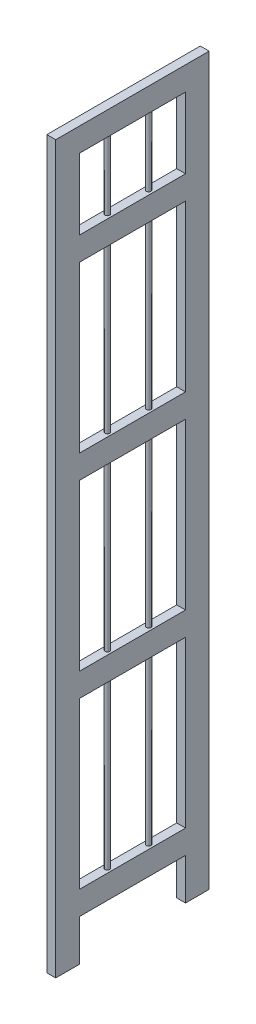
ISO-10303-21;
HEADER;
FILE_DESCRIPTION(('STEP AP214'),'2;1');
FILE_NAME('part.step','',(''),(''),'','','');
FILE_SCHEMA(('AUTOMOTIVE_DESIGN { 1 0 10303 214 1 1 1 1 }'));
ENDSEC;
DATA;
#1=APPLICATION_CONTEXT('core data for automotive mechanical design processes');
#2=APPLICATION_PROTOCOL_DEFINITION('international standard','automotive_design',2000,#1);
#3=PRODUCT_CONTEXT('',#1,'mechanical');
#4=PRODUCT('Part','Part','',(#3));
#5=PRODUCT_RELATED_PRODUCT_CATEGORY('part','',(#4));
#6=PRODUCT_DEFINITION_FORMATION('','',#4);
#7=PRODUCT_DEFINITION_CONTEXT('part definition',#1,'design');
#8=PRODUCT_DEFINITION('design','',#6,#7);
#9=PRODUCT_DEFINITION_SHAPE('','',#8);
#10=(LENGTH_UNIT() NAMED_UNIT(*) SI_UNIT(.MILLI.,.METRE.));
#11=(NAMED_UNIT(*) PLANE_ANGLE_UNIT() SI_UNIT($,.RADIAN.));
#12=(NAMED_UNIT(*) SI_UNIT($,.STERADIAN.) SOLID_ANGLE_UNIT());
#13=UNCERTAINTY_MEASURE_WITH_UNIT(LENGTH_MEASURE(1.E-05),#10,'distance_accuracy_value','');
#14=(GEOMETRIC_REPRESENTATION_CONTEXT(3) GLOBAL_UNCERTAINTY_ASSIGNED_CONTEXT((#13)) GLOBAL_UNIT_ASSIGNED_CONTEXT((#10,
#11,#12)) REPRESENTATION_CONTEXT('',''));
#15=CARTESIAN_POINT('',(0.,0.,0.));
#16=DIRECTION('',(0.,0.,1.));
#17=DIRECTION('',(1.,0.,0.));
#18=AXIS2_PLACEMENT_3D('',#15,#16,#17);
#19=CARTESIAN_POINT('',(-15.,1190.,90.));
#20=DIRECTION('',(0.,-1.,0.));
#21=DIRECTION('',(0.,0.,-1.));
#22=AXIS2_PLACEMENT_3D('',#19,#20,#21);
#23=PLANE('',#22);
#24=CARTESIAN_POINT('',(-7.5,1190.,-35.));
#25=DIRECTION('',(0.,-1.,0.));
#26=DIRECTION('',(0.,0.,-1.));
#27=AXIS2_PLACEMENT_3D('',#24,#25,#26);
#28=CIRCLE('',#27,4.);
#29=CARTESIAN_POINT('',(-7.5,1190.,-39.));
#30=VERTEX_POINT('',#29);
#31=EDGE_CURVE('E11',#30,#30,#28,.T.);
#32=ORIENTED_EDGE('',*,*,#31,.F.);
#33=EDGE_LOOP('',(#32));
#34=FACE_BOUND('',#33,.T.);
#35=DIRECTION('',(0.,0.,-1.));
#36=VECTOR('',#35,1.);
#37=CARTESIAN_POINT('',(0.,1190.,90.));
#38=LINE('',#37,#36);
#39=CARTESIAN_POINT('',(0.,1190.,90.));
#40=VERTEX_POINT('',#39);
#41=CARTESIAN_POINT('',(0.,1190.,-90.));
#42=VERTEX_POINT('',#41);
#43=EDGE_CURVE('E228',#40,#42,#38,.T.);
#44=ORIENTED_EDGE('',*,*,#43,.F.);
#45=DIRECTION('',(1.,0.,0.));
#46=VECTOR('',#45,1.);
#47=CARTESIAN_POINT('',(-15.,1190.,90.));
#48=LINE('',#47,#46);
#49=CARTESIAN_POINT('',(-15.,1190.,90.));
#50=VERTEX_POINT('',#49);
#51=EDGE_CURVE('E263',#50,#40,#48,.T.);
#52=ORIENTED_EDGE('',*,*,#51,.F.);
#53=DIRECTION('',(0.,0.,-1.));
#54=VECTOR('',#53,1.);
#55=CARTESIAN_POINT('',(-15.,1190.,90.));
#56=LINE('',#55,#54);
#57=CARTESIAN_POINT('',(-15.,1190.,-90.));
#58=VERTEX_POINT('',#57);
#59=EDGE_CURVE('E386',#50,#58,#56,.T.);
#60=ORIENTED_EDGE('',*,*,#59,.T.);
#61=DIRECTION('',(1.,0.,0.));
#62=VECTOR('',#61,1.);
#63=CARTESIAN_POINT('',(-15.,1190.,-90.));
#64=LINE('',#63,#62);
#65=EDGE_CURVE('E261',#58,#42,#64,.T.);
#66=ORIENTED_EDGE('',*,*,#65,.T.);
#67=EDGE_LOOP('',(#44,#52,#60,#66));
#68=FACE_BOUND('',#67,.T.);
#69=CARTESIAN_POINT('',(-7.5,1190.,35.));
#70=DIRECTION('',(0.,-1.,0.));
#71=DIRECTION('',(0.,0.,-1.));
#72=AXIS2_PLACEMENT_3D('',#69,#70,#71);
#73=CIRCLE('',#72,4.);
#74=CARTESIAN_POINT('',(-7.5,1190.,31.));
#75=VERTEX_POINT('',#74);
#76=EDGE_CURVE('E273',#75,#75,#73,.T.);
#77=ORIENTED_EDGE('',*,*,#76,.F.);
#78=EDGE_LOOP('',(#77));
#79=FACE_BOUND('',#78,.T.);
#80=ADVANCED_FACE('F35',(#34,#68,#79),#23,.T.);
#81=CARTESIAN_POINT('',(-199.390889145858,110.,90.));
#82=DIRECTION('',(0.,1.,0.));
#83=DIRECTION('',(0.,0.,1.));
#84=AXIS2_PLACEMENT_3D('',#81,#82,#83);
#85=PLANE('',#84);
#86=CARTESIAN_POINT('',(-7.5,110.,-35.));
#87=DIRECTION('',(0.,1.,0.));
#88=DIRECTION('',(0.,0.,1.));
#89=AXIS2_PLACEMENT_3D('',#86,#87,#88);
#90=CIRCLE('',#89,4.);
#91=CARTESIAN_POINT('',(-7.5,110.,-31.));
#92=VERTEX_POINT('',#91);
#93=EDGE_CURVE('E43',#92,#92,#90,.T.);
#94=ORIENTED_EDGE('',*,*,#93,.F.);
#95=EDGE_LOOP('',(#94));
#96=FACE_BOUND('',#95,.T.);
#97=DIRECTION('',(0.,0.,-1.));
#98=VECTOR('',#97,1.);
#99=CARTESIAN_POINT('',(-15.,110.,90.));
#100=LINE('',#99,#98);
#101=CARTESIAN_POINT('',(-15.,110.,90.));
#102=VERTEX_POINT('',#101);
#103=CARTESIAN_POINT('',(-15.,110.,-90.));
#104=VERTEX_POINT('',#103);
#105=EDGE_CURVE('E360',#102,#104,#100,.T.);
#106=ORIENTED_EDGE('',*,*,#105,.F.);
#107=DIRECTION('',(1.,0.,0.));
#108=VECTOR('',#107,1.);
#109=CARTESIAN_POINT('',(-199.390889145858,110.,90.));
#110=LINE('',#109,#108);
#111=CARTESIAN_POINT('',(0.,110.,90.));
#112=VERTEX_POINT('',#111);
#113=EDGE_CURVE('E364',#102,#112,#110,.T.);
#114=ORIENTED_EDGE('',*,*,#113,.T.);
#115=DIRECTION('',(0.,0.,1.));
#116=VECTOR('',#115,1.);
#117=CARTESIAN_POINT('',(0.,110.,90.));
#118=LINE('',#117,#116);
#119=CARTESIAN_POINT('',(0.,110.,-90.));
#120=VERTEX_POINT('',#119);
#121=EDGE_CURVE('E366',#120,#112,#118,.T.);
#122=ORIENTED_EDGE('',*,*,#121,.F.);
#123=DIRECTION('',(1.,0.,0.));
#124=VECTOR('',#123,1.);
#125=CARTESIAN_POINT('',(-199.390889145858,110.,-90.));
#126=LINE('',#125,#124);
#127=EDGE_CURVE('E371',#104,#120,#126,.T.);
#128=ORIENTED_EDGE('',*,*,#127,.F.);
#129=EDGE_LOOP('',(#106,#114,#122,#128));
#130=FACE_BOUND('',#129,.T.);
#131=CARTESIAN_POINT('',(-7.5,110.,35.));
#132=DIRECTION('',(0.,1.,0.));
#133=DIRECTION('',(0.,0.,1.));
#134=AXIS2_PLACEMENT_3D('',#131,#132,#133);
#135=CIRCLE('',#134,4.);
#136=CARTESIAN_POINT('',(-7.5,110.,39.));
#137=VERTEX_POINT('',#136);
#138=EDGE_CURVE('E290',#137,#137,#135,.T.);
#139=ORIENTED_EDGE('',*,*,#138,.F.);
#140=EDGE_LOOP('',(#139));
#141=FACE_BOUND('',#140,.T.);
#142=ADVANCED_FACE('F483',(#96,#130,#141),#85,.T.);
#143=CARTESIAN_POINT('',(-199.390889145858,430.,90.));
#144=DIRECTION('',(0.,1.,0.));
#145=DIRECTION('',(0.,0.,1.));
#146=AXIS2_PLACEMENT_3D('',#143,#144,#145);
#147=PLANE('',#146);
#148=CARTESIAN_POINT('',(-7.5,430.,-35.));
#149=DIRECTION('',(0.,1.,0.));
#150=DIRECTION('',(0.,0.,1.));
#151=AXIS2_PLACEMENT_3D('',#148,#149,#150);
#152=CIRCLE('',#151,4.);
#153=CARTESIAN_POINT('',(-7.5,430.,-31.));
#154=VERTEX_POINT('',#153);
#155=EDGE_CURVE('E277',#154,#154,#152,.T.);
#156=ORIENTED_EDGE('',*,*,#155,.F.);
#157=EDGE_LOOP('',(#156));
#158=FACE_BOUND('',#157,.T.);
#159=DIRECTION('',(0.,0.,-1.));
#160=VECTOR('',#159,1.);
#161=CARTESIAN_POINT('',(-15.,430.,90.));
#162=LINE('',#161,#160);
#163=CARTESIAN_POINT('',(-15.,430.,90.));
#164=VERTEX_POINT('',#163);
#165=CARTESIAN_POINT('',(-15.,430.,-90.));
#166=VERTEX_POINT('',#165);
#167=EDGE_CURVE('E339',#164,#166,#162,.T.);
#168=ORIENTED_EDGE('',*,*,#167,.F.);
#169=DIRECTION('',(1.,0.,0.));
#170=VECTOR('',#169,1.);
#171=CARTESIAN_POINT('',(-199.390889145858,430.,90.));
#172=LINE('',#171,#170);
#173=CARTESIAN_POINT('',(0.,430.,90.));
#174=VERTEX_POINT('',#173);
#175=EDGE_CURVE('E343',#164,#174,#172,.T.);
#176=ORIENTED_EDGE('',*,*,#175,.T.);
#177=DIRECTION('',(0.,0.,1.));
#178=VECTOR('',#177,1.);
#179=CARTESIAN_POINT('',(0.,430.,90.));
#180=LINE('',#179,#178);
#181=CARTESIAN_POINT('',(0.,430.,-90.));
#182=VERTEX_POINT('',#181);
#183=EDGE_CURVE('E345',#182,#174,#180,.T.);
#184=ORIENTED_EDGE('',*,*,#183,.F.);
#185=DIRECTION('',(1.,0.,0.));
#186=VECTOR('',#185,1.);
#187=CARTESIAN_POINT('',(-199.390889145858,430.,-90.));
#188=LINE('',#187,#186);
#189=EDGE_CURVE('E350',#166,#182,#188,.T.);
#190=ORIENTED_EDGE('',*,*,#189,.F.);
#191=EDGE_LOOP('',(#168,#176,#184,#190));
#192=FACE_BOUND('',#191,.T.);
#193=CARTESIAN_POINT('',(-7.5,430.,35.));
#194=DIRECTION('',(0.,1.,0.));
#195=DIRECTION('',(0.,0.,1.));
#196=AXIS2_PLACEMENT_3D('',#193,#194,#195);
#197=CIRCLE('',#196,4.);
#198=CARTESIAN_POINT('',(-7.5,430.,39.));
#199=VERTEX_POINT('',#198);
#200=EDGE_CURVE('E203',#199,#199,#197,.F.);
#201=ORIENTED_EDGE('',*,*,#200,.T.);
#202=EDGE_LOOP('',(#201));
#203=FACE_BOUND('',#202,.T.);
#204=ADVANCED_FACE('F489',(#158,#192,#203),#147,.T.);
#205=CARTESIAN_POINT('',(-199.390889145858,390.,90.));
#206=DIRECTION('',(0.,-1.,0.));
#207=DIRECTION('',(0.,0.,-1.));
#208=AXIS2_PLACEMENT_3D('',#205,#206,#207);
#209=PLANE('',#208);
#210=CARTESIAN_POINT('',(-7.5,390.,-35.));
#211=DIRECTION('',(0.,-1.,0.));
#212=DIRECTION('',(0.,0.,-1.));
#213=AXIS2_PLACEMENT_3D('',#210,#211,#212);
#214=CIRCLE('',#213,4.);
#215=CARTESIAN_POINT('',(-7.5,390.,-39.));
#216=VERTEX_POINT('',#215);
#217=EDGE_CURVE('E281',#216,#216,#214,.T.);
#218=ORIENTED_EDGE('',*,*,#217,.F.);
#219=EDGE_LOOP('',(#218));
#220=FACE_BOUND('',#219,.T.);
#221=DIRECTION('',(0.,0.,1.));
#222=VECTOR('',#221,1.);
#223=CARTESIAN_POINT('',(-15.,390.,90.));
#224=LINE('',#223,#222);
#225=CARTESIAN_POINT('',(-15.,390.,-90.));
#226=VERTEX_POINT('',#225);
#227=CARTESIAN_POINT('',(-15.,390.,90.));
#228=VERTEX_POINT('',#227);
#229=EDGE_CURVE('E342',#226,#228,#224,.T.);
#230=ORIENTED_EDGE('',*,*,#229,.F.);
#231=DIRECTION('',(1.,0.,0.));
#232=VECTOR('',#231,1.);
#233=CARTESIAN_POINT('',(-199.390889145858,390.,-90.));
#234=LINE('',#233,#232);
#235=CARTESIAN_POINT('',(0.,390.,-90.));
#236=VERTEX_POINT('',#235);
#237=EDGE_CURVE('E353',#226,#236,#234,.T.);
#238=ORIENTED_EDGE('',*,*,#237,.T.);
#239=DIRECTION('',(0.,0.,-1.));
#240=VECTOR('',#239,1.);
#241=CARTESIAN_POINT('',(0.,390.,90.));
#242=LINE('',#241,#240);
#243=CARTESIAN_POINT('',(0.,390.,90.));
#244=VERTEX_POINT('',#243);
#245=EDGE_CURVE('E338',#244,#236,#242,.T.);
#246=ORIENTED_EDGE('',*,*,#245,.F.);
#247=DIRECTION('',(1.,0.,0.));
#248=VECTOR('',#247,1.);
#249=CARTESIAN_POINT('',(-199.390889145858,390.,90.));
#250=LINE('',#249,#248);
#251=EDGE_CURVE('E347',#228,#244,#250,.T.);
#252=ORIENTED_EDGE('',*,*,#251,.F.);
#253=EDGE_LOOP('',(#230,#238,#246,#252));
#254=FACE_BOUND('',#253,.T.);
#255=CARTESIAN_POINT('',(-7.5,390.,35.));
#256=DIRECTION('',(0.,-1.,0.));
#257=DIRECTION('',(0.,0.,-1.));
#258=AXIS2_PLACEMENT_3D('',#255,#256,#257);
#259=CIRCLE('',#258,4.);
#260=CARTESIAN_POINT('',(-7.5,390.,31.));
#261=VERTEX_POINT('',#260);
#262=EDGE_CURVE('E303',#261,#261,#259,.F.);
#263=ORIENTED_EDGE('',*,*,#262,.T.);
#264=EDGE_LOOP('',(#263));
#265=FACE_BOUND('',#264,.T.);
#266=ADVANCED_FACE('F454',(#220,#254,#265),#209,.T.);
#267=CARTESIAN_POINT('',(-199.390889145858,750.,90.));
#268=DIRECTION('',(0.,1.,0.));
#269=DIRECTION('',(0.,0.,1.));
#270=AXIS2_PLACEMENT_3D('',#267,#268,#269);
#271=PLANE('',#270);
#272=CARTESIAN_POINT('',(-7.5,750.,-35.));
#273=DIRECTION('',(0.,1.,0.));
#274=DIRECTION('',(0.,0.,1.));
#275=AXIS2_PLACEMENT_3D('',#272,#273,#274);
#276=CIRCLE('',#275,4.);
#277=CARTESIAN_POINT('',(-7.5,750.,-31.));
#278=VERTEX_POINT('',#277);
#279=EDGE_CURVE('E286',#278,#278,#276,.T.);
#280=ORIENTED_EDGE('',*,*,#279,.F.);
#281=EDGE_LOOP('',(#280));
#282=FACE_BOUND('',#281,.T.);
#283=DIRECTION('',(0.,0.,-1.));
#284=VECTOR('',#283,1.);
#285=CARTESIAN_POINT('',(-15.,750.,90.));
#286=LINE('',#285,#284);
#287=CARTESIAN_POINT('',(-15.,750.,90.));
#288=VERTEX_POINT('',#287);
#289=CARTESIAN_POINT('',(-15.,750.,-90.));
#290=VERTEX_POINT('',#289);
#291=EDGE_CURVE('E320',#288,#290,#286,.T.);
#292=ORIENTED_EDGE('',*,*,#291,.F.);
#293=DIRECTION('',(1.,0.,0.));
#294=VECTOR('',#293,1.);
#295=CARTESIAN_POINT('',(-199.390889145858,750.,90.));
#296=LINE('',#295,#294);
#297=CARTESIAN_POINT('',(0.,750.,90.));
#298=VERTEX_POINT('',#297);
#299=EDGE_CURVE('E324',#288,#298,#296,.T.);
#300=ORIENTED_EDGE('',*,*,#299,.T.);
#301=DIRECTION('',(0.,0.,1.));
#302=VECTOR('',#301,1.);
#303=CARTESIAN_POINT('',(0.,750.,90.));
#304=LINE('',#303,#302);
#305=CARTESIAN_POINT('',(0.,750.,-90.));
#306=VERTEX_POINT('',#305);
#307=EDGE_CURVE('E216',#306,#298,#304,.T.);
#308=ORIENTED_EDGE('',*,*,#307,.F.);
#309=DIRECTION('',(1.,0.,0.));
#310=VECTOR('',#309,1.);
#311=CARTESIAN_POINT('',(-199.390889145858,750.,-90.));
#312=LINE('',#311,#310);
#313=EDGE_CURVE('E329',#290,#306,#312,.T.);
#314=ORIENTED_EDGE('',*,*,#313,.F.);
#315=EDGE_LOOP('',(#292,#300,#308,#314));
#316=FACE_BOUND('',#315,.T.);
#317=CARTESIAN_POINT('',(-7.5,750.,35.));
#318=DIRECTION('',(0.,1.,0.));
#319=DIRECTION('',(0.,0.,1.));
#320=AXIS2_PLACEMENT_3D('',#317,#318,#319);
#321=CIRCLE('',#320,4.);
#322=CARTESIAN_POINT('',(-7.5,750.,39.));
#323=VERTEX_POINT('',#322);
#324=EDGE_CURVE('E300',#323,#323,#321,.F.);
#325=ORIENTED_EDGE('',*,*,#324,.T.);
#326=EDGE_LOOP('',(#325));
#327=FACE_BOUND('',#326,.T.);
#328=ADVANCED_FACE('F450',(#282,#316,#327),#271,.T.);
#329=CARTESIAN_POINT('',(-199.390889145858,710.,90.));
#330=DIRECTION('',(0.,-1.,0.));
#331=DIRECTION('',(0.,0.,-1.));
#332=AXIS2_PLACEMENT_3D('',#329,#330,#331);
#333=PLANE('',#332);
#334=CARTESIAN_POINT('',(-7.5,710.,-35.));
#335=DIRECTION('',(0.,-1.,0.));
#336=DIRECTION('',(0.,0.,-1.));
#337=AXIS2_PLACEMENT_3D('',#334,#335,#336);
#338=CIRCLE('',#337,4.);
#339=CARTESIAN_POINT('',(-7.5,710.,-39.));
#340=VERTEX_POINT('',#339);
#341=EDGE_CURVE('E615',#340,#340,#338,.T.);
#342=ORIENTED_EDGE('',*,*,#341,.F.);
#343=EDGE_LOOP('',(#342));
#344=FACE_BOUND('',#343,.T.);
#345=DIRECTION('',(0.,0.,1.));
#346=VECTOR('',#345,1.);
#347=CARTESIAN_POINT('',(-15.,710.,90.));
#348=LINE('',#347,#346);
#349=CARTESIAN_POINT('',(-15.,710.,-90.));
#350=VERTEX_POINT('',#349);
#351=CARTESIAN_POINT('',(-15.,710.,90.));
#352=VERTEX_POINT('',#351);
#353=EDGE_CURVE('E323',#350,#352,#348,.T.);
#354=ORIENTED_EDGE('',*,*,#353,.F.);
#355=DIRECTION('',(1.,0.,0.));
#356=VECTOR('',#355,1.);
#357=CARTESIAN_POINT('',(-199.390889145858,710.,-90.));
#358=LINE('',#357,#356);
#359=CARTESIAN_POINT('',(0.,710.,-90.));
#360=VERTEX_POINT('',#359);
#361=EDGE_CURVE('E332',#350,#360,#358,.T.);
#362=ORIENTED_EDGE('',*,*,#361,.T.);
#363=DIRECTION('',(0.,0.,-1.));
#364=VECTOR('',#363,1.);
#365=CARTESIAN_POINT('',(0.,710.,90.));
#366=LINE('',#365,#364);
#367=CARTESIAN_POINT('',(0.,710.,90.));
#368=VERTEX_POINT('',#367);
#369=EDGE_CURVE('E319',#368,#360,#366,.T.);
#370=ORIENTED_EDGE('',*,*,#369,.F.);
#371=DIRECTION('',(1.,0.,0.));
#372=VECTOR('',#371,1.);
#373=CARTESIAN_POINT('',(-199.390889145858,710.,90.));
#374=LINE('',#373,#372);
#375=EDGE_CURVE('E327',#352,#368,#374,.T.);
#376=ORIENTED_EDGE('',*,*,#375,.F.);
#377=EDGE_LOOP('',(#354,#362,#370,#376));
#378=FACE_BOUND('',#377,.T.);
#379=CARTESIAN_POINT('',(-7.5,710.,35.));
#380=DIRECTION('',(0.,-1.,0.));
#381=DIRECTION('',(0.,0.,-1.));
#382=AXIS2_PLACEMENT_3D('',#379,#380,#381);
#383=CIRCLE('',#382,4.);
#384=CARTESIAN_POINT('',(-7.5,710.,31.));
#385=VERTEX_POINT('',#384);
#386=EDGE_CURVE('E297',#385,#385,#383,.F.);
#387=ORIENTED_EDGE('',*,*,#386,.T.);
#388=EDGE_LOOP('',(#387));
#389=FACE_BOUND('',#388,.T.);
#390=ADVANCED_FACE('F453',(#344,#378,#389),#333,.T.);
#391=CARTESIAN_POINT('',(-199.390889145858,1070.,90.));
#392=DIRECTION('',(0.,1.,0.));
#393=DIRECTION('',(0.,0.,1.));
#394=AXIS2_PLACEMENT_3D('',#391,#392,#393);
#395=PLANE('',#394);
#396=CARTESIAN_POINT('',(-7.5,1070.,-35.));
#397=DIRECTION('',(0.,1.,0.));
#398=DIRECTION('',(0.,0.,1.));
#399=AXIS2_PLACEMENT_3D('',#396,#397,#398);
#400=CIRCLE('',#399,4.);
#401=CARTESIAN_POINT('',(-7.5,1070.,-31.));
#402=VERTEX_POINT('',#401);
#403=EDGE_CURVE('E275',#402,#402,#400,.T.);
#404=ORIENTED_EDGE('',*,*,#403,.F.);
#405=EDGE_LOOP('',(#404));
#406=FACE_BOUND('',#405,.T.);
#407=DIRECTION('',(0.,0.,-1.));
#408=VECTOR('',#407,1.);
#409=CARTESIAN_POINT('',(-15.,1070.,90.));
#410=LINE('',#409,#408);
#411=CARTESIAN_POINT('',(-15.,1070.,90.));
#412=VERTEX_POINT('',#411);
#413=CARTESIAN_POINT('',(-15.,1070.,-90.));
#414=VERTEX_POINT('',#413);
#415=EDGE_CURVE('E308',#412,#414,#410,.T.);
#416=ORIENTED_EDGE('',*,*,#415,.F.);
#417=DIRECTION('',(1.,0.,0.));
#418=VECTOR('',#417,1.);
#419=CARTESIAN_POINT('',(-199.390889145858,1070.,90.));
#420=LINE('',#419,#418);
#421=CARTESIAN_POINT('',(0.,1070.,90.));
#422=VERTEX_POINT('',#421);
#423=EDGE_CURVE('E310',#412,#422,#420,.T.);
#424=ORIENTED_EDGE('',*,*,#423,.T.);
#425=DIRECTION('',(0.,0.,1.));
#426=VECTOR('',#425,1.);
#427=CARTESIAN_POINT('',(0.,1070.,90.));
#428=LINE('',#427,#426);
#429=CARTESIAN_POINT('',(0.,1070.,-90.));
#430=VERTEX_POINT('',#429);
#431=EDGE_CURVE('E58',#430,#422,#428,.T.);
#432=ORIENTED_EDGE('',*,*,#431,.F.);
#433=DIRECTION('',(1.,0.,0.));
#434=VECTOR('',#433,1.);
#435=CARTESIAN_POINT('',(-199.390889145858,1070.,-90.));
#436=LINE('',#435,#434);
#437=EDGE_CURVE('E314',#414,#430,#436,.T.);
#438=ORIENTED_EDGE('',*,*,#437,.F.);
#439=EDGE_LOOP('',(#416,#424,#432,#438));
#440=FACE_BOUND('',#439,.T.);
#441=CARTESIAN_POINT('',(-7.5,1070.,35.));
#442=DIRECTION('',(0.,1.,0.));
#443=DIRECTION('',(0.,0.,1.));
#444=AXIS2_PLACEMENT_3D('',#441,#442,#443);
#445=CIRCLE('',#444,4.);
#446=CARTESIAN_POINT('',(-7.5,1070.,39.));
#447=VERTEX_POINT('',#446);
#448=EDGE_CURVE('E272',#447,#447,#445,.F.);
#449=ORIENTED_EDGE('',*,*,#448,.T.);
#450=EDGE_LOOP('',(#449));
#451=FACE_BOUND('',#450,.T.);
#452=ADVANCED_FACE('F469',(#406,#440,#451),#395,.T.);
#453=CARTESIAN_POINT('',(-199.390889145858,1030.,90.));
#454=DIRECTION('',(0.,-1.,0.));
#455=DIRECTION('',(0.,0.,-1.));
#456=AXIS2_PLACEMENT_3D('',#453,#454,#455);
#457=PLANE('',#456);
#458=CARTESIAN_POINT('',(-7.5,1030.,-35.));
#459=DIRECTION('',(0.,-1.,0.));
#460=DIRECTION('',(0.,0.,-1.));
#461=AXIS2_PLACEMENT_3D('',#458,#459,#460);
#462=CIRCLE('',#461,4.);
#463=CARTESIAN_POINT('',(-7.5,1030.,-39.));
#464=VERTEX_POINT('',#463);
#465=EDGE_CURVE('E251',#464,#464,#462,.T.);
#466=ORIENTED_EDGE('',*,*,#465,.F.);
#467=EDGE_LOOP('',(#466));
#468=FACE_BOUND('',#467,.T.);
#469=DIRECTION('',(0.,0.,1.));
#470=VECTOR('',#469,1.);
#471=CARTESIAN_POINT('',(-15.,1030.,90.));
#472=LINE('',#471,#470);
#473=CARTESIAN_POINT('',(-15.,1030.,-90.));
#474=VERTEX_POINT('',#473);
#475=CARTESIAN_POINT('',(-15.,1030.,90.));
#476=VERTEX_POINT('',#475);
#477=EDGE_CURVE('E309',#474,#476,#472,.T.);
#478=ORIENTED_EDGE('',*,*,#477,.F.);
#479=DIRECTION('',(1.,0.,0.));
#480=VECTOR('',#479,1.);
#481=CARTESIAN_POINT('',(-199.390889145858,1030.,-90.));
#482=LINE('',#481,#480);
#483=CARTESIAN_POINT('',(0.,1030.,-90.));
#484=VERTEX_POINT('',#483);
#485=EDGE_CURVE('E201',#474,#484,#482,.T.);
#486=ORIENTED_EDGE('',*,*,#485,.T.);
#487=DIRECTION('',(0.,0.,-1.));
#488=VECTOR('',#487,1.);
#489=CARTESIAN_POINT('',(0.,1030.,90.));
#490=LINE('',#489,#488);
#491=CARTESIAN_POINT('',(0.,1030.,90.));
#492=VERTEX_POINT('',#491);
#493=EDGE_CURVE('E50',#492,#484,#490,.T.);
#494=ORIENTED_EDGE('',*,*,#493,.F.);
#495=DIRECTION('',(1.,0.,0.));
#496=VECTOR('',#495,1.);
#497=CARTESIAN_POINT('',(-199.390889145858,1030.,90.));
#498=LINE('',#497,#496);
#499=EDGE_CURVE('E198',#476,#492,#498,.T.);
#500=ORIENTED_EDGE('',*,*,#499,.F.);
#501=EDGE_LOOP('',(#478,#486,#494,#500));
#502=FACE_BOUND('',#501,.T.);
#503=CARTESIAN_POINT('',(-7.5,1030.,35.));
#504=DIRECTION('',(0.,-1.,0.));
#505=DIRECTION('',(0.,0.,-1.));
#506=AXIS2_PLACEMENT_3D('',#503,#504,#505);
#507=CIRCLE('',#506,4.);
#508=CARTESIAN_POINT('',(-7.5,1030.,31.));
#509=VERTEX_POINT('',#508);
#510=EDGE_CURVE('E269',#509,#509,#507,.F.);
#511=ORIENTED_EDGE('',*,*,#510,.T.);
#512=EDGE_LOOP('',(#511));
#513=FACE_BOUND('',#512,.T.);
#514=ADVANCED_FACE('F196',(#468,#502,#513),#457,.T.);
#515=CARTESIAN_POINT('',(-15.,0.,-90.));
#516=DIRECTION('',(0.,0.,1.));
#517=DIRECTION('',(1.,0.,0.));
#518=AXIS2_PLACEMENT_3D('',#515,#516,#517);
#519=PLANE('',#518);
#520=ORIENTED_EDGE('',*,*,#437,.T.);
#521=DIRECTION('',(0.,-1.,0.));
#522=VECTOR('',#521,1.);
#523=CARTESIAN_POINT('',(0.,0.,-90.));
#524=LINE('',#523,#522);
#525=EDGE_CURVE('E233',#42,#430,#524,.T.);
#526=ORIENTED_EDGE('',*,*,#525,.F.);
#527=ORIENTED_EDGE('',*,*,#65,.F.);
#528=DIRECTION('',(0.,-1.,0.));
#529=VECTOR('',#528,1.);
#530=CARTESIAN_POINT('',(-15.,0.,-90.));
#531=LINE('',#530,#529);
#532=EDGE_CURVE('E391',#58,#414,#531,.T.);
#533=ORIENTED_EDGE('',*,*,#532,.T.);
#534=EDGE_LOOP('',(#520,#526,#527,#533));
#535=FACE_BOUND('',#534,.T.);
#536=ADVANCED_FACE('F468',(#535),#519,.T.);
#537=CARTESIAN_POINT('',(-15.,0.,90.));
#538=DIRECTION('',(0.,0.,-1.));
#539=DIRECTION('',(-1.,0.,0.));
#540=AXIS2_PLACEMENT_3D('',#537,#538,#539);
#541=PLANE('',#540);
#542=ORIENTED_EDGE('',*,*,#423,.F.);
#543=DIRECTION('',(0.,1.,0.));
#544=VECTOR('',#543,1.);
#545=CARTESIAN_POINT('',(-15.,0.,90.));
#546=LINE('',#545,#544);
#547=EDGE_CURVE('E382',#412,#50,#546,.T.);
#548=ORIENTED_EDGE('',*,*,#547,.T.);
#549=ORIENTED_EDGE('',*,*,#51,.T.);
#550=DIRECTION('',(0.,1.,0.));
#551=VECTOR('',#550,1.);
#552=CARTESIAN_POINT('',(0.,0.,90.));
#553=LINE('',#552,#551);
#554=EDGE_CURVE('E219',#422,#40,#553,.T.);
#555=ORIENTED_EDGE('',*,*,#554,.F.);
#556=EDGE_LOOP('',(#542,#548,#549,#555));
#557=FACE_BOUND('',#556,.T.);
#558=ADVANCED_FACE('F476',(#557),#541,.T.);
#559=ORIENTED_EDGE('',*,*,#485,.F.);
#560=EDGE_CURVE('E395',#474,#290,#531,.T.);
#561=ORIENTED_EDGE('',*,*,#560,.T.);
#562=ORIENTED_EDGE('',*,*,#313,.T.);
#563=EDGE_CURVE('E236',#484,#306,#524,.T.);
#564=ORIENTED_EDGE('',*,*,#563,.F.);
#565=EDGE_LOOP('',(#559,#561,#562,#564));
#566=FACE_BOUND('',#565,.T.);
#567=ADVANCED_FACE('F445',(#566),#519,.T.);
#568=ORIENTED_EDGE('',*,*,#499,.T.);
#569=EDGE_CURVE('E209',#298,#492,#553,.T.);
#570=ORIENTED_EDGE('',*,*,#569,.F.);
#571=ORIENTED_EDGE('',*,*,#299,.F.);
#572=EDGE_CURVE('E211',#288,#476,#546,.T.);
#573=ORIENTED_EDGE('',*,*,#572,.T.);
#574=EDGE_LOOP('',(#568,#570,#571,#573));
#575=FACE_BOUND('',#574,.T.);
#576=ADVANCED_FACE('F207',(#575),#541,.T.);
#577=ORIENTED_EDGE('',*,*,#361,.F.);
#578=EDGE_CURVE('E436',#350,#166,#531,.T.);
#579=ORIENTED_EDGE('',*,*,#578,.T.);
#580=ORIENTED_EDGE('',*,*,#189,.T.);
#581=EDGE_CURVE('E688',#360,#182,#524,.T.);
#582=ORIENTED_EDGE('',*,*,#581,.F.);
#583=EDGE_LOOP('',(#577,#579,#580,#582));
#584=FACE_BOUND('',#583,.T.);
#585=ADVANCED_FACE('F515',(#584),#519,.T.);
#586=ORIENTED_EDGE('',*,*,#375,.T.);
#587=EDGE_CURVE('E218',#174,#368,#553,.T.);
#588=ORIENTED_EDGE('',*,*,#587,.F.);
#589=ORIENTED_EDGE('',*,*,#175,.F.);
#590=EDGE_CURVE('E668',#164,#352,#546,.T.);
#591=ORIENTED_EDGE('',*,*,#590,.T.);
#592=EDGE_LOOP('',(#586,#588,#589,#591));
#593=FACE_BOUND('',#592,.T.);
#594=ADVANCED_FACE('F510',(#593),#541,.T.);
#595=ORIENTED_EDGE('',*,*,#237,.F.);
#596=EDGE_CURVE('E435',#226,#104,#531,.T.);
#597=ORIENTED_EDGE('',*,*,#596,.T.);
#598=ORIENTED_EDGE('',*,*,#127,.T.);
#599=EDGE_CURVE('E684',#236,#120,#524,.T.);
#600=ORIENTED_EDGE('',*,*,#599,.F.);
#601=EDGE_LOOP('',(#595,#597,#598,#600));
#602=FACE_BOUND('',#601,.T.);
#603=ADVANCED_FACE('F505',(#602),#519,.T.);
#604=ORIENTED_EDGE('',*,*,#251,.T.);
#605=EDGE_CURVE('E222',#112,#244,#553,.T.);
#606=ORIENTED_EDGE('',*,*,#605,.F.);
#607=ORIENTED_EDGE('',*,*,#113,.F.);
#608=EDGE_CURVE('E387',#102,#228,#546,.T.);
#609=ORIENTED_EDGE('',*,*,#608,.T.);
#610=EDGE_LOOP('',(#604,#606,#607,#609));
#611=FACE_BOUND('',#610,.T.);
#612=ADVANCED_FACE('F498',(#611),#541,.T.);
#613=CARTESIAN_POINT('',(-15.,0.,130.));
#614=DIRECTION('',(0.,-1.,0.));
#615=DIRECTION('',(0.,0.,-1.));
#616=AXIS2_PLACEMENT_3D('',#613,#614,#615);
#617=PLANE('',#616);
#618=DIRECTION('',(0.,0.,-1.));
#619=VECTOR('',#618,1.);
#620=CARTESIAN_POINT('',(0.,0.,130.));
#621=LINE('',#620,#619);
#622=CARTESIAN_POINT('',(0.,0.,130.));
#623=VERTEX_POINT('',#622);
#624=CARTESIAN_POINT('',(0.,0.,90.));
#625=VERTEX_POINT('',#624);
#626=EDGE_CURVE('E223',#623,#625,#621,.T.);
#627=ORIENTED_EDGE('',*,*,#626,.F.);
#628=DIRECTION('',(1.,0.,0.));
#629=VECTOR('',#628,1.);
#630=CARTESIAN_POINT('',(-15.,0.,130.));
#631=LINE('',#630,#629);
#632=CARTESIAN_POINT('',(-15.,0.,130.));
#633=VERTEX_POINT('',#632);
#634=EDGE_CURVE('E249',#633,#623,#631,.T.);
#635=ORIENTED_EDGE('',*,*,#634,.F.);
#636=DIRECTION('',(0.,0.,-1.));
#637=VECTOR('',#636,1.);
#638=CARTESIAN_POINT('',(-15.,0.,130.));
#639=LINE('',#638,#637);
#640=CARTESIAN_POINT('',(-15.,0.,90.));
#641=VERTEX_POINT('',#640);
#642=EDGE_CURVE('E248',#633,#641,#639,.T.);
#643=ORIENTED_EDGE('',*,*,#642,.T.);
#644=DIRECTION('',(1.,0.,0.));
#645=VECTOR('',#644,1.);
#646=CARTESIAN_POINT('',(-15.,0.,90.));
#647=LINE('',#646,#645);
#648=EDGE_CURVE('E266',#641,#625,#647,.T.);
#649=ORIENTED_EDGE('',*,*,#648,.T.);
#650=EDGE_LOOP('',(#627,#635,#643,#649));
#651=FACE_BOUND('',#650,.T.);
#652=ADVANCED_FACE('F37',(#651),#617,.T.);
#653=CARTESIAN_POINT('',(-15.,0.,130.));
#654=DIRECTION('',(0.,0.,1.));
#655=DIRECTION('',(1.,0.,0.));
#656=AXIS2_PLACEMENT_3D('',#653,#654,#655);
#657=PLANE('',#656);
#658=DIRECTION('',(0.,-1.,0.));
#659=VECTOR('',#658,1.);
#660=CARTESIAN_POINT('',(0.,0.,130.));
#661=LINE('',#660,#659);
#662=CARTESIAN_POINT('',(0.,1230.,130.));
#663=VERTEX_POINT('',#662);
#664=EDGE_CURVE('E245',#663,#623,#661,.T.);
#665=ORIENTED_EDGE('',*,*,#664,.F.);
#666=DIRECTION('',(1.,0.,0.));
#667=VECTOR('',#666,1.);
#668=CARTESIAN_POINT('',(-15.,1230.,130.));
#669=LINE('',#668,#667);
#670=CARTESIAN_POINT('',(-15.,1230.,130.));
#671=VERTEX_POINT('',#670);
#672=EDGE_CURVE('E252',#671,#663,#669,.T.);
#673=ORIENTED_EDGE('',*,*,#672,.F.);
#674=DIRECTION('',(0.,-1.,0.));
#675=VECTOR('',#674,1.);
#676=CARTESIAN_POINT('',(-15.,0.,130.));
#677=LINE('',#676,#675);
#678=EDGE_CURVE('E268',#671,#633,#677,.T.);
#679=ORIENTED_EDGE('',*,*,#678,.T.);
#680=ORIENTED_EDGE('',*,*,#634,.T.);
#681=EDGE_LOOP('',(#665,#673,#679,#680));
#682=FACE_BOUND('',#681,.T.);
#683=ADVANCED_FACE('F407',(#682),#657,.T.);
#684=CARTESIAN_POINT('',(-15.,1230.,130.));
#685=DIRECTION('',(0.,1.,0.));
#686=DIRECTION('',(0.,0.,1.));
#687=AXIS2_PLACEMENT_3D('',#684,#685,#686);
#688=PLANE('',#687);
#689=DIRECTION('',(0.,0.,1.));
#690=VECTOR('',#689,1.);
#691=CARTESIAN_POINT('',(0.,1230.,130.));
#692=LINE('',#691,#690);
#693=CARTESIAN_POINT('',(0.,1230.,-130.));
#694=VERTEX_POINT('',#693);
#695=EDGE_CURVE('E242',#694,#663,#692,.T.);
#696=ORIENTED_EDGE('',*,*,#695,.F.);
#697=DIRECTION('',(1.,0.,0.));
#698=VECTOR('',#697,1.);
#699=CARTESIAN_POINT('',(-15.,1230.,-130.));
#700=LINE('',#699,#698);
#701=CARTESIAN_POINT('',(-15.,1230.,-130.));
#702=VERTEX_POINT('',#701);
#703=EDGE_CURVE('E254',#702,#694,#700,.T.);
#704=ORIENTED_EDGE('',*,*,#703,.F.);
#705=DIRECTION('',(0.,0.,1.));
#706=VECTOR('',#705,1.);
#707=CARTESIAN_POINT('',(-15.,1230.,130.));
#708=LINE('',#707,#706);
#709=EDGE_CURVE('E401',#702,#671,#708,.T.);
#710=ORIENTED_EDGE('',*,*,#709,.T.);
#711=ORIENTED_EDGE('',*,*,#672,.T.);
#712=EDGE_LOOP('',(#696,#704,#710,#711));
#713=FACE_BOUND('',#712,.T.);
#714=ADVANCED_FACE('F422',(#713),#688,.T.);
#715=CARTESIAN_POINT('',(-15.,0.,-130.));
#716=DIRECTION('',(0.,0.,-1.));
#717=DIRECTION('',(-1.,0.,0.));
#718=AXIS2_PLACEMENT_3D('',#715,#716,#717);
#719=PLANE('',#718);
#720=DIRECTION('',(0.,1.,0.));
#721=VECTOR('',#720,1.);
#722=CARTESIAN_POINT('',(0.,0.,-130.));
#723=LINE('',#722,#721);
#724=CARTESIAN_POINT('',(0.,0.,-130.));
#725=VERTEX_POINT('',#724);
#726=EDGE_CURVE('E239',#725,#694,#723,.T.);
#727=ORIENTED_EDGE('',*,*,#726,.F.);
#728=DIRECTION('',(1.,0.,0.));
#729=VECTOR('',#728,1.);
#730=CARTESIAN_POINT('',(-15.,0.,-130.));
#731=LINE('',#730,#729);
#732=CARTESIAN_POINT('',(-15.,0.,-130.));
#733=VERTEX_POINT('',#732);
#734=EDGE_CURVE('E256',#733,#725,#731,.T.);
#735=ORIENTED_EDGE('',*,*,#734,.F.);
#736=DIRECTION('',(0.,1.,0.));
#737=VECTOR('',#736,1.);
#738=CARTESIAN_POINT('',(-15.,0.,-130.));
#739=LINE('',#738,#737);
#740=EDGE_CURVE('E398',#733,#702,#739,.T.);
#741=ORIENTED_EDGE('',*,*,#740,.T.);
#742=ORIENTED_EDGE('',*,*,#703,.T.);
#743=EDGE_LOOP('',(#727,#735,#741,#742));
#744=FACE_BOUND('',#743,.T.);
#745=ADVANCED_FACE('F424',(#744),#719,.T.);
#746=CARTESIAN_POINT('',(-15.,0.,-90.));
#747=DIRECTION('',(0.,-1.,0.));
#748=DIRECTION('',(0.,0.,-1.));
#749=AXIS2_PLACEMENT_3D('',#746,#747,#748);
#750=PLANE('',#749);
#751=DIRECTION('',(0.,0.,-1.));
#752=VECTOR('',#751,1.);
#753=CARTESIAN_POINT('',(0.,0.,-90.));
#754=LINE('',#753,#752);
#755=CARTESIAN_POINT('',(0.,0.,-90.));
#756=VERTEX_POINT('',#755);
#757=EDGE_CURVE('E235',#756,#725,#754,.T.);
#758=ORIENTED_EDGE('',*,*,#757,.F.);
#759=DIRECTION('',(1.,0.,0.));
#760=VECTOR('',#759,1.);
#761=CARTESIAN_POINT('',(-15.,0.,-90.));
#762=LINE('',#761,#760);
#763=CARTESIAN_POINT('',(-15.,0.,-90.));
#764=VERTEX_POINT('',#763);
#765=EDGE_CURVE('E258',#764,#756,#762,.T.);
#766=ORIENTED_EDGE('',*,*,#765,.F.);
#767=DIRECTION('',(0.,0.,-1.));
#768=VECTOR('',#767,1.);
#769=CARTESIAN_POINT('',(-15.,0.,-90.));
#770=LINE('',#769,#768);
#771=EDGE_CURVE('E394',#764,#733,#770,.T.);
#772=ORIENTED_EDGE('',*,*,#771,.T.);
#773=ORIENTED_EDGE('',*,*,#734,.T.);
#774=EDGE_LOOP('',(#758,#766,#772,#773));
#775=FACE_BOUND('',#774,.T.);
#776=ADVANCED_FACE('F430',(#775),#750,.T.);
#777=DIRECTION('',(1.,0.,0.));
#778=VECTOR('',#777,1.);
#779=CARTESIAN_POINT('',(-199.390889145858,70.0000000000001,-90.));
#780=LINE('',#779,#778);
#781=CARTESIAN_POINT('',(-15.,70.0000000000001,-90.));
#782=VERTEX_POINT('',#781);
#783=CARTESIAN_POINT('',(0.,70.,-90.));
#784=VERTEX_POINT('',#783);
#785=EDGE_CURVE('E374',#782,#784,#780,.T.);
#786=ORIENTED_EDGE('',*,*,#785,.F.);
#787=EDGE_CURVE('E390',#782,#764,#531,.T.);
#788=ORIENTED_EDGE('',*,*,#787,.T.);
#789=ORIENTED_EDGE('',*,*,#765,.T.);
#790=EDGE_CURVE('E232',#784,#756,#524,.T.);
#791=ORIENTED_EDGE('',*,*,#790,.F.);
#792=EDGE_LOOP('',(#786,#788,#789,#791));
#793=FACE_BOUND('',#792,.T.);
#794=ADVANCED_FACE('F434',(#793),#519,.T.);
#795=DIRECTION('',(1.,0.,0.));
#796=VECTOR('',#795,1.);
#797=CARTESIAN_POINT('',(-199.390889145858,70.,90.));
#798=LINE('',#797,#796);
#799=CARTESIAN_POINT('',(-15.,70.,90.));
#800=VERTEX_POINT('',#799);
#801=CARTESIAN_POINT('',(0.,70.,90.));
#802=VERTEX_POINT('',#801);
#803=EDGE_CURVE('E368',#800,#802,#798,.T.);
#804=ORIENTED_EDGE('',*,*,#803,.T.);
#805=EDGE_CURVE('E224',#625,#802,#553,.T.);
#806=ORIENTED_EDGE('',*,*,#805,.F.);
#807=ORIENTED_EDGE('',*,*,#648,.F.);
#808=EDGE_CURVE('E383',#641,#800,#546,.T.);
#809=ORIENTED_EDGE('',*,*,#808,.T.);
#810=EDGE_LOOP('',(#804,#806,#807,#809));
#811=FACE_BOUND('',#810,.T.);
#812=ADVANCED_FACE('F495',(#811),#541,.T.);
#813=CARTESIAN_POINT('',(-15.,0.,0.));
#814=DIRECTION('',(1.,0.,0.));
#815=DIRECTION('',(0.,0.,-1.));
#816=AXIS2_PLACEMENT_3D('',#813,#814,#815);
#817=PLANE('',#816);
#818=ORIENTED_EDGE('',*,*,#547,.F.);
#819=ORIENTED_EDGE('',*,*,#415,.T.);
#820=ORIENTED_EDGE('',*,*,#532,.F.);
#821=ORIENTED_EDGE('',*,*,#59,.F.);
#822=EDGE_LOOP('',(#818,#819,#820,#821));
#823=FACE_BOUND('',#822,.T.);
#824=ORIENTED_EDGE('',*,*,#572,.F.);
#825=ORIENTED_EDGE('',*,*,#291,.T.);
#826=ORIENTED_EDGE('',*,*,#560,.F.);
#827=ORIENTED_EDGE('',*,*,#477,.T.);
#828=EDGE_LOOP('',(#824,#825,#826,#827));
#829=FACE_BOUND('',#828,.T.);
#830=ORIENTED_EDGE('',*,*,#590,.F.);
#831=ORIENTED_EDGE('',*,*,#167,.T.);
#832=ORIENTED_EDGE('',*,*,#578,.F.);
#833=ORIENTED_EDGE('',*,*,#353,.T.);
#834=EDGE_LOOP('',(#830,#831,#832,#833));
#835=FACE_BOUND('',#834,.T.);
#836=ORIENTED_EDGE('',*,*,#608,.F.);
#837=ORIENTED_EDGE('',*,*,#105,.T.);
#838=ORIENTED_EDGE('',*,*,#596,.F.);
#839=ORIENTED_EDGE('',*,*,#229,.T.);
#840=EDGE_LOOP('',(#836,#837,#838,#839));
#841=FACE_BOUND('',#840,.T.);
#842=ORIENTED_EDGE('',*,*,#642,.F.);
#843=ORIENTED_EDGE('',*,*,#678,.F.);
#844=ORIENTED_EDGE('',*,*,#709,.F.);
#845=ORIENTED_EDGE('',*,*,#740,.F.);
#846=ORIENTED_EDGE('',*,*,#771,.F.);
#847=ORIENTED_EDGE('',*,*,#787,.F.);
#848=DIRECTION('',(0.,0.,1.));
#849=VECTOR('',#848,1.);
#850=CARTESIAN_POINT('',(-15.,70.,90.));
#851=LINE('',#850,#849);
#852=EDGE_CURVE('E363',#782,#800,#851,.T.);
#853=ORIENTED_EDGE('',*,*,#852,.T.);
#854=ORIENTED_EDGE('',*,*,#808,.F.);
#855=EDGE_LOOP('',(#842,#843,#844,#845,#846,#847,#853,#854));
#856=FACE_BOUND('',#855,.T.);
#857=ADVANCED_FACE('F412',(#823,#829,#835,#841,#856),#817,.F.);
#858=CARTESIAN_POINT('',(0.,0.,0.));
#859=DIRECTION('',(1.,0.,0.));
#860=DIRECTION('',(0.,0.,-1.));
#861=AXIS2_PLACEMENT_3D('',#858,#859,#860);
#862=PLANE('',#861);
#863=ORIENTED_EDGE('',*,*,#569,.T.);
#864=ORIENTED_EDGE('',*,*,#493,.T.);
#865=ORIENTED_EDGE('',*,*,#563,.T.);
#866=ORIENTED_EDGE('',*,*,#307,.T.);
#867=EDGE_LOOP('',(#863,#864,#865,#866));
#868=FACE_BOUND('',#867,.T.);
#869=ORIENTED_EDGE('',*,*,#587,.T.);
#870=ORIENTED_EDGE('',*,*,#369,.T.);
#871=ORIENTED_EDGE('',*,*,#581,.T.);
#872=ORIENTED_EDGE('',*,*,#183,.T.);
#873=EDGE_LOOP('',(#869,#870,#871,#872));
#874=FACE_BOUND('',#873,.T.);
#875=ORIENTED_EDGE('',*,*,#605,.T.);
#876=ORIENTED_EDGE('',*,*,#245,.T.);
#877=ORIENTED_EDGE('',*,*,#599,.T.);
#878=ORIENTED_EDGE('',*,*,#121,.T.);
#879=EDGE_LOOP('',(#875,#876,#877,#878));
#880=FACE_BOUND('',#879,.T.);
#881=ORIENTED_EDGE('',*,*,#805,.T.);
#882=DIRECTION('',(0.,0.,-1.));
#883=VECTOR('',#882,1.);
#884=CARTESIAN_POINT('',(0.,70.,90.));
#885=LINE('',#884,#883);
#886=EDGE_CURVE('E359',#802,#784,#885,.T.);
#887=ORIENTED_EDGE('',*,*,#886,.T.);
#888=ORIENTED_EDGE('',*,*,#790,.T.);
#889=ORIENTED_EDGE('',*,*,#757,.T.);
#890=ORIENTED_EDGE('',*,*,#726,.T.);
#891=ORIENTED_EDGE('',*,*,#695,.T.);
#892=ORIENTED_EDGE('',*,*,#664,.T.);
#893=ORIENTED_EDGE('',*,*,#626,.T.);
#894=EDGE_LOOP('',(#881,#887,#888,#889,#890,#891,#892,#893));
#895=FACE_BOUND('',#894,.T.);
#896=ORIENTED_EDGE('',*,*,#431,.T.);
#897=ORIENTED_EDGE('',*,*,#554,.T.);
#898=ORIENTED_EDGE('',*,*,#43,.T.);
#899=ORIENTED_EDGE('',*,*,#525,.T.);
#900=EDGE_LOOP('',(#896,#897,#898,#899));
#901=FACE_BOUND('',#900,.T.);
#902=ADVANCED_FACE('F213',(#868,#874,#880,#895,#901),#862,.T.);
#903=CARTESIAN_POINT('',(-199.390889145858,70.,90.));
#904=DIRECTION('',(0.,-1.,0.));
#905=DIRECTION('',(0.,0.,-1.));
#906=AXIS2_PLACEMENT_3D('',#903,#904,#905);
#907=PLANE('',#906);
#908=ORIENTED_EDGE('',*,*,#852,.F.);
#909=ORIENTED_EDGE('',*,*,#785,.T.);
#910=ORIENTED_EDGE('',*,*,#886,.F.);
#911=ORIENTED_EDGE('',*,*,#803,.F.);
#912=EDGE_LOOP('',(#908,#909,#910,#911));
#913=FACE_BOUND('',#912,.T.);
#914=ADVANCED_FACE('F463',(#913),#907,.T.);
#915=CARTESIAN_POINT('',(-7.5,1201.31370849898,35.));
#916=DIRECTION('',(0.,-1.,0.));
#917=DIRECTION('',(0.,0.,-1.));
#918=AXIS2_PLACEMENT_3D('',#915,#916,#917);
#919=CYLINDRICAL_SURFACE('',#918,4.);
#920=ORIENTED_EDGE('',*,*,#324,.F.);
#921=EDGE_LOOP('',(#920));
#922=FACE_BOUND('',#921,.T.);
#923=ORIENTED_EDGE('',*,*,#510,.F.);
#924=EDGE_LOOP('',(#923));
#925=FACE_BOUND('',#924,.T.);
#926=ADVANCED_FACE('F459',(#922,#925),#919,.T.);
#927=ORIENTED_EDGE('',*,*,#448,.F.);
#928=EDGE_LOOP('',(#927));
#929=FACE_BOUND('',#928,.T.);
#930=ORIENTED_EDGE('',*,*,#76,.T.);
#931=EDGE_LOOP('',(#930));
#932=FACE_BOUND('',#931,.T.);
#933=ADVANCED_FACE('F462',(#929,#932),#919,.T.);
#934=ORIENTED_EDGE('',*,*,#200,.F.);
#935=EDGE_LOOP('',(#934));
#936=FACE_BOUND('',#935,.T.);
#937=ORIENTED_EDGE('',*,*,#386,.F.);
#938=EDGE_LOOP('',(#937));
#939=FACE_BOUND('',#938,.T.);
#940=ADVANCED_FACE('F465',(#936,#939),#919,.T.);
#941=ORIENTED_EDGE('',*,*,#262,.F.);
#942=EDGE_LOOP('',(#941));
#943=FACE_BOUND('',#942,.T.);
#944=ORIENTED_EDGE('',*,*,#138,.T.);
#945=EDGE_LOOP('',(#944));
#946=FACE_BOUND('',#945,.T.);
#947=ADVANCED_FACE('F621',(#943,#946),#919,.T.);
#948=CARTESIAN_POINT('',(-7.5,1201.31370849898,-35.));
#949=DIRECTION('',(0.,-1.,0.));
#950=DIRECTION('',(0.,0.,-1.));
#951=AXIS2_PLACEMENT_3D('',#948,#949,#950);
#952=CYLINDRICAL_SURFACE('',#951,4.);
#953=ORIENTED_EDGE('',*,*,#279,.T.);
#954=EDGE_LOOP('',(#953));
#955=FACE_BOUND('',#954,.T.);
#956=ORIENTED_EDGE('',*,*,#465,.T.);
#957=EDGE_LOOP('',(#956));
#958=FACE_BOUND('',#957,.T.);
#959=ADVANCED_FACE('F627',(#955,#958),#952,.T.);
#960=ORIENTED_EDGE('',*,*,#403,.T.);
#961=EDGE_LOOP('',(#960));
#962=FACE_BOUND('',#961,.T.);
#963=ORIENTED_EDGE('',*,*,#31,.T.);
#964=EDGE_LOOP('',(#963));
#965=FACE_BOUND('',#964,.T.);
#966=ADVANCED_FACE('F636',(#962,#965),#952,.T.);
#967=ORIENTED_EDGE('',*,*,#155,.T.);
#968=EDGE_LOOP('',(#967));
#969=FACE_BOUND('',#968,.T.);
#970=ORIENTED_EDGE('',*,*,#341,.T.);
#971=EDGE_LOOP('',(#970));
#972=FACE_BOUND('',#971,.T.);
#973=ADVANCED_FACE('F634',(#969,#972),#952,.T.);
#974=ORIENTED_EDGE('',*,*,#217,.T.);
#975=EDGE_LOOP('',(#974));
#976=FACE_BOUND('',#975,.T.);
#977=ORIENTED_EDGE('',*,*,#93,.T.);
#978=EDGE_LOOP('',(#977));
#979=FACE_BOUND('',#978,.T.);
#980=ADVANCED_FACE('F632',(#976,#979),#952,.T.);
#981=CLOSED_SHELL('',(#80,#142,#204,#266,#328,#390,#452,#514,#536,#558,#567,#576,#585,#594,#603,
#612,#652,#683,#714,#745,#776,#794,#812,#857,#902,#914,#926,#933,#940,#947,#959,#966,#973,#980));
#982=MANIFOLD_SOLID_BREP('B2',#981);
#983=ADVANCED_BREP_SHAPE_REPRESENTATION('',(#18,#982),#14);
#984=SHAPE_DEFINITION_REPRESENTATION(#9,#983);
ENDSEC;
END-ISO-10303-21;
